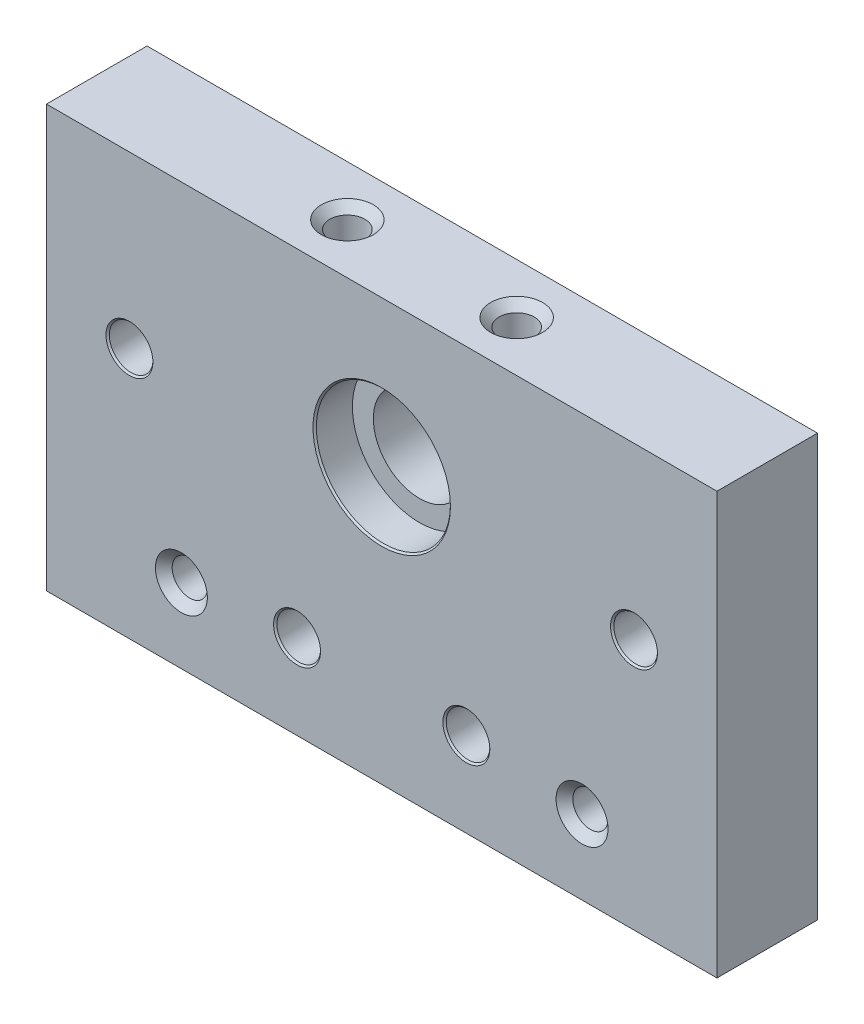
ISO-10303-21;
HEADER;
FILE_DESCRIPTION(('STEP AP214'),'2;1');
FILE_NAME('part.step','',(''),(''),'','','');
FILE_SCHEMA(('AUTOMOTIVE_DESIGN { 1 0 10303 214 1 1 1 1 }'));
ENDSEC;
DATA;
#1=APPLICATION_CONTEXT('core data for automotive mechanical design processes');
#2=APPLICATION_PROTOCOL_DEFINITION('international standard','automotive_design',2000,#1);
#3=PRODUCT_CONTEXT('',#1,'mechanical');
#4=PRODUCT('Part','Part','',(#3));
#5=PRODUCT_RELATED_PRODUCT_CATEGORY('part','',(#4));
#6=PRODUCT_DEFINITION_FORMATION('','',#4);
#7=PRODUCT_DEFINITION_CONTEXT('part definition',#1,'design');
#8=PRODUCT_DEFINITION('design','',#6,#7);
#9=PRODUCT_DEFINITION_SHAPE('','',#8);
#10=(LENGTH_UNIT() NAMED_UNIT(*) SI_UNIT(.MILLI.,.METRE.));
#11=(NAMED_UNIT(*) PLANE_ANGLE_UNIT() SI_UNIT($,.RADIAN.));
#12=(NAMED_UNIT(*) SI_UNIT($,.STERADIAN.) SOLID_ANGLE_UNIT());
#13=UNCERTAINTY_MEASURE_WITH_UNIT(LENGTH_MEASURE(1.E-05),#10,'distance_accuracy_value','');
#14=(GEOMETRIC_REPRESENTATION_CONTEXT(3) GLOBAL_UNCERTAINTY_ASSIGNED_CONTEXT((#13)) GLOBAL_UNIT_ASSIGNED_CONTEXT((#10,
#11,#12)) REPRESENTATION_CONTEXT('',''));
#15=CARTESIAN_POINT('',(0.,0.,0.));
#16=DIRECTION('',(0.,0.,1.));
#17=DIRECTION('',(1.,0.,0.));
#18=AXIS2_PLACEMENT_3D('',#15,#16,#17);
#19=CARTESIAN_POINT('',(28.7831305387227,6.79975085139503,5.36743547306151));
#20=DIRECTION('',(0.,0.,-1.));
#21=DIRECTION('',(-1.,0.,0.));
#22=AXIS2_PLACEMENT_3D('',#19,#20,#21);
#23=CYLINDRICAL_SURFACE('',#22,2.6);
#24=CARTESIAN_POINT('',(28.7831305387227,6.79975085139503,5.1674354730615));
#25=DIRECTION('',(0.,0.,1.));
#26=DIRECTION('',(1.,0.,0.));
#27=AXIS2_PLACEMENT_3D('',#24,#25,#26);
#28=CIRCLE('',#27,2.6);
#29=CARTESIAN_POINT('',(31.3831305387227,6.79975085139503,5.1674354730615));
#30=VERTEX_POINT('',#29);
#31=EDGE_CURVE('E141',#30,#30,#28,.T.);
#32=ORIENTED_EDGE('',*,*,#31,.T.);
#33=EDGE_LOOP('',(#32));
#34=FACE_BOUND('',#33,.T.);
#35=CARTESIAN_POINT('',(28.7831305387227,6.79975085139503,-4.63256452693849));
#36=DIRECTION('',(0.,0.,-1.));
#37=DIRECTION('',(-1.,0.,0.));
#38=AXIS2_PLACEMENT_3D('',#35,#36,#37);
#39=CIRCLE('',#38,2.6);
#40=CARTESIAN_POINT('',(26.1831305387227,6.79975085139503,-4.63256452693849));
#41=VERTEX_POINT('',#40);
#42=EDGE_CURVE('E108',#41,#41,#39,.T.);
#43=ORIENTED_EDGE('',*,*,#42,.T.);
#44=EDGE_LOOP('',(#43));
#45=FACE_BOUND('',#44,.T.);
#46=ADVANCED_FACE('F16',(#34,#45),#23,.F.);
#47=CARTESIAN_POINT('',(8.78313053872271,-13.100249148605,5.36743547306151));
#48=DIRECTION('',(0.,0.,-1.));
#49=DIRECTION('',(-1.,0.,0.));
#50=AXIS2_PLACEMENT_3D('',#47,#48,#49);
#51=CYLINDRICAL_SURFACE('',#50,2.6);
#52=CARTESIAN_POINT('',(8.78313053872271,-13.100249148605,5.1674354730615));
#53=DIRECTION('',(0.,0.,1.));
#54=DIRECTION('',(1.,0.,0.));
#55=AXIS2_PLACEMENT_3D('',#52,#53,#54);
#56=CIRCLE('',#55,2.6);
#57=CARTESIAN_POINT('',(11.3831305387227,-13.100249148605,5.1674354730615));
#58=VERTEX_POINT('',#57);
#59=EDGE_CURVE('E159',#58,#58,#56,.T.);
#60=ORIENTED_EDGE('',*,*,#59,.T.);
#61=EDGE_LOOP('',(#60));
#62=FACE_BOUND('',#61,.T.);
#63=CARTESIAN_POINT('',(8.78313053872271,-13.100249148605,-4.63256452693849));
#64=DIRECTION('',(0.,0.,-1.));
#65=DIRECTION('',(-1.,0.,0.));
#66=AXIS2_PLACEMENT_3D('',#63,#64,#65);
#67=CIRCLE('',#66,2.6);
#68=CARTESIAN_POINT('',(6.18313053872271,-13.100249148605,-4.63256452693849));
#69=VERTEX_POINT('',#68);
#70=EDGE_CURVE('E105',#69,#69,#67,.T.);
#71=ORIENTED_EDGE('',*,*,#70,.T.);
#72=EDGE_LOOP('',(#71));
#73=FACE_BOUND('',#72,.T.);
#74=ADVANCED_FACE('F216',(#62,#73),#51,.F.);
#75=CARTESIAN_POINT('',(-31.4168694612773,6.79975085139502,5.36743547306151));
#76=DIRECTION('',(0.,0.,-1.));
#77=DIRECTION('',(-1.,0.,0.));
#78=AXIS2_PLACEMENT_3D('',#75,#76,#77);
#79=CYLINDRICAL_SURFACE('',#78,2.6);
#80=CARTESIAN_POINT('',(-31.4168694612773,6.79975085139502,5.1674354730615));
#81=DIRECTION('',(0.,0.,1.));
#82=DIRECTION('',(1.,0.,0.));
#83=AXIS2_PLACEMENT_3D('',#80,#81,#82);
#84=CIRCLE('',#83,2.6);
#85=CARTESIAN_POINT('',(-28.8168694612773,6.79975085139502,5.1674354730615));
#86=VERTEX_POINT('',#85);
#87=EDGE_CURVE('E168',#86,#86,#84,.T.);
#88=ORIENTED_EDGE('',*,*,#87,.T.);
#89=EDGE_LOOP('',(#88));
#90=FACE_BOUND('',#89,.T.);
#91=CARTESIAN_POINT('',(-31.4168694612773,6.79975085139502,-4.63256452693849));
#92=DIRECTION('',(0.,0.,-1.));
#93=DIRECTION('',(-1.,0.,0.));
#94=AXIS2_PLACEMENT_3D('',#91,#92,#93);
#95=CIRCLE('',#94,2.6);
#96=CARTESIAN_POINT('',(-34.0168694612773,6.79975085139502,-4.63256452693849));
#97=VERTEX_POINT('',#96);
#98=EDGE_CURVE('E101',#97,#97,#95,.T.);
#99=ORIENTED_EDGE('',*,*,#98,.T.);
#100=EDGE_LOOP('',(#99));
#101=FACE_BOUND('',#100,.T.);
#102=ADVANCED_FACE('F222',(#90,#101),#79,.F.);
#103=CARTESIAN_POINT('',(-11.4168694612773,-13.100249148605,5.36743547306151));
#104=DIRECTION('',(0.,0.,-1.));
#105=DIRECTION('',(-1.,0.,0.));
#106=AXIS2_PLACEMENT_3D('',#103,#104,#105);
#107=CYLINDRICAL_SURFACE('',#106,2.6);
#108=CARTESIAN_POINT('',(-11.4168694612773,-13.100249148605,5.1674354730615));
#109=DIRECTION('',(0.,0.,1.));
#110=DIRECTION('',(1.,0.,0.));
#111=AXIS2_PLACEMENT_3D('',#108,#109,#110);
#112=CIRCLE('',#111,2.6);
#113=CARTESIAN_POINT('',(-8.81686946127732,-13.100249148605,5.1674354730615));
#114=VERTEX_POINT('',#113);
#115=EDGE_CURVE('E162',#114,#114,#112,.T.);
#116=ORIENTED_EDGE('',*,*,#115,.T.);
#117=EDGE_LOOP('',(#116));
#118=FACE_BOUND('',#117,.T.);
#119=CARTESIAN_POINT('',(-11.4168694612773,-13.100249148605,-4.63256452693849));
#120=DIRECTION('',(0.,0.,-1.));
#121=DIRECTION('',(-1.,0.,0.));
#122=AXIS2_PLACEMENT_3D('',#119,#120,#121);
#123=CIRCLE('',#122,2.6);
#124=CARTESIAN_POINT('',(-14.0168694612773,-13.100249148605,-4.63256452693849));
#125=VERTEX_POINT('',#124);
#126=EDGE_CURVE('E98',#125,#125,#123,.T.);
#127=ORIENTED_EDGE('',*,*,#126,.T.);
#128=EDGE_LOOP('',(#127));
#129=FACE_BOUND('',#128,.T.);
#130=ADVANCED_FACE('F231',(#118,#129),#107,.F.);
#131=CARTESIAN_POINT('',(-1.31686946127731,9.59975085139505,5.36743547306151));
#132=DIRECTION('',(0.,0.,-1.));
#133=DIRECTION('',(-1.,0.,0.));
#134=AXIS2_PLACEMENT_3D('',#131,#132,#133);
#135=CYLINDRICAL_SURFACE('',#134,5.5);
#136=CARTESIAN_POINT('',(-1.31686946127731,9.59975085139505,-6.43256452693849));
#137=DIRECTION('',(0.,0.,1.));
#138=DIRECTION('',(1.,0.,0.));
#139=AXIS2_PLACEMENT_3D('',#136,#137,#138);
#140=CIRCLE('',#139,5.5);
#141=CARTESIAN_POINT('',(4.18313053872269,9.59975085139505,-6.43256452693849));
#142=VERTEX_POINT('',#141);
#143=EDGE_CURVE('E135',#142,#142,#140,.F.);
#144=ORIENTED_EDGE('',*,*,#143,.T.);
#145=EDGE_LOOP('',(#144));
#146=FACE_BOUND('',#145,.T.);
#147=CARTESIAN_POINT('',(-1.31686946127731,9.59975085139505,0.867435473061505));
#148=DIRECTION('',(0.,0.,1.));
#149=DIRECTION('',(1.,0.,0.));
#150=AXIS2_PLACEMENT_3D('',#147,#148,#149);
#151=CIRCLE('',#150,5.5);
#152=CARTESIAN_POINT('',(4.18313053872269,9.59975085139505,0.867435473061505));
#153=VERTEX_POINT('',#152);
#154=EDGE_CURVE('E87',#153,#153,#151,.T.);
#155=ORIENTED_EDGE('',*,*,#154,.T.);
#156=EDGE_LOOP('',(#155));
#157=FACE_BOUND('',#156,.T.);
#158=ADVANCED_FACE('F228',(#146,#157),#135,.F.);
#159=CARTESIAN_POINT('',(-1.31686946127731,1.94975085139505,5.36743547306151));
#160=DIRECTION('',(0.,0.,1.));
#161=DIRECTION('',(1.,0.,0.));
#162=AXIS2_PLACEMENT_3D('',#159,#160,#161);
#163=PLANE('',#162);
#164=CARTESIAN_POINT('',(22.5831305387227,-14.300249148605,5.36743547306151));
#165=DIRECTION('',(0.,0.,1.));
#166=DIRECTION('',(1.,0.,0.));
#167=AXIS2_PLACEMENT_3D('',#164,#165,#166);
#168=CIRCLE('',#167,3.10000000000001);
#169=CARTESIAN_POINT('',(25.6831305387227,-14.300249148605,5.36743547306151));
#170=VERTEX_POINT('',#169);
#171=EDGE_CURVE('E198',#170,#170,#168,.F.);
#172=ORIENTED_EDGE('',*,*,#171,.T.);
#173=EDGE_LOOP('',(#172));
#174=FACE_BOUND('',#173,.T.);
#175=CARTESIAN_POINT('',(-25.2168694612773,-14.300249148605,5.36743547306151));
#176=DIRECTION('',(0.,0.,1.));
#177=DIRECTION('',(1.,0.,0.));
#178=AXIS2_PLACEMENT_3D('',#175,#176,#177);
#179=CIRCLE('',#178,3.09999999999999);
#180=CARTESIAN_POINT('',(-22.1168694612773,-14.300249148605,5.36743547306151));
#181=VERTEX_POINT('',#180);
#182=EDGE_CURVE('E195',#181,#181,#179,.F.);
#183=ORIENTED_EDGE('',*,*,#182,.T.);
#184=EDGE_LOOP('',(#183));
#185=FACE_BOUND('',#184,.T.);
#186=CARTESIAN_POINT('',(28.7831305387227,6.79975085139503,5.36743547306151));
#187=DIRECTION('',(0.,0.,1.));
#188=DIRECTION('',(1.,0.,0.));
#189=AXIS2_PLACEMENT_3D('',#186,#187,#188);
#190=CIRCLE('',#189,2.8);
#191=CARTESIAN_POINT('',(31.5831305387227,6.79975085139503,5.36743547306151));
#192=VERTEX_POINT('',#191);
#193=EDGE_CURVE('E156',#192,#192,#190,.F.);
#194=ORIENTED_EDGE('',*,*,#193,.T.);
#195=EDGE_LOOP('',(#194));
#196=FACE_BOUND('',#195,.T.);
#197=CARTESIAN_POINT('',(8.78313053872271,-13.100249148605,5.36743547306151));
#198=DIRECTION('',(0.,0.,1.));
#199=DIRECTION('',(1.,0.,0.));
#200=AXIS2_PLACEMENT_3D('',#197,#198,#199);
#201=CIRCLE('',#200,2.8);
#202=CARTESIAN_POINT('',(11.5831305387227,-13.100249148605,5.36743547306151));
#203=VERTEX_POINT('',#202);
#204=EDGE_CURVE('E153',#203,#203,#201,.F.);
#205=ORIENTED_EDGE('',*,*,#204,.T.);
#206=EDGE_LOOP('',(#205));
#207=FACE_BOUND('',#206,.T.);
#208=CARTESIAN_POINT('',(-11.4168694612773,-13.100249148605,5.36743547306151));
#209=DIRECTION('',(0.,0.,1.));
#210=DIRECTION('',(1.,0.,0.));
#211=AXIS2_PLACEMENT_3D('',#208,#209,#210);
#212=CIRCLE('',#211,2.8);
#213=CARTESIAN_POINT('',(-8.61686946127733,-13.100249148605,5.36743547306151));
#214=VERTEX_POINT('',#213);
#215=EDGE_CURVE('E150',#214,#214,#212,.F.);
#216=ORIENTED_EDGE('',*,*,#215,.T.);
#217=EDGE_LOOP('',(#216));
#218=FACE_BOUND('',#217,.T.);
#219=CARTESIAN_POINT('',(-1.31686946127731,9.59975085139505,5.36743547306151));
#220=DIRECTION('',(0.,0.,1.));
#221=DIRECTION('',(1.,0.,0.));
#222=AXIS2_PLACEMENT_3D('',#219,#220,#221);
#223=CIRCLE('',#222,8.2);
#224=CARTESIAN_POINT('',(6.88313053872269,9.59975085139505,5.36743547306151));
#225=VERTEX_POINT('',#224);
#226=EDGE_CURVE('E147',#225,#225,#223,.F.);
#227=ORIENTED_EDGE('',*,*,#226,.T.);
#228=EDGE_LOOP('',(#227));
#229=FACE_BOUND('',#228,.T.);
#230=CARTESIAN_POINT('',(-31.4168694612773,6.79975085139502,5.36743547306151));
#231=DIRECTION('',(0.,0.,1.));
#232=DIRECTION('',(1.,0.,0.));
#233=AXIS2_PLACEMENT_3D('',#230,#231,#232);
#234=CIRCLE('',#233,2.8);
#235=CARTESIAN_POINT('',(-28.6168694612773,6.79975085139502,5.36743547306151));
#236=VERTEX_POINT('',#235);
#237=EDGE_CURVE('E144',#236,#236,#234,.F.);
#238=ORIENTED_EDGE('',*,*,#237,.T.);
#239=EDGE_LOOP('',(#238));
#240=FACE_BOUND('',#239,.T.);
#241=DIRECTION('',(0.,-1.,0.));
#242=VECTOR('',#241,1.);
#243=CARTESIAN_POINT('',(-41.3168694612773,-23.200249148605,5.36743547306151));
#244=LINE('',#243,#242);
#245=CARTESIAN_POINT('',(-41.3168694612773,27.099750851395,5.36743547306151));
#246=VERTEX_POINT('',#245);
#247=CARTESIAN_POINT('',(-41.3168694612773,-23.200249148605,5.36743547306151));
#248=VERTEX_POINT('',#247);
#249=EDGE_CURVE('E69',#246,#248,#244,.T.);
#250=ORIENTED_EDGE('',*,*,#249,.T.);
#251=DIRECTION('',(1.,0.,0.));
#252=VECTOR('',#251,1.);
#253=CARTESIAN_POINT('',(38.6831305387227,-23.200249148605,5.36743547306151));
#254=LINE('',#253,#252);
#255=CARTESIAN_POINT('',(38.6831305387227,-23.200249148605,5.36743547306151));
#256=VERTEX_POINT('',#255);
#257=EDGE_CURVE('E64',#248,#256,#254,.T.);
#258=ORIENTED_EDGE('',*,*,#257,.T.);
#259=DIRECTION('',(0.,1.,0.));
#260=VECTOR('',#259,1.);
#261=CARTESIAN_POINT('',(38.6831305387227,-23.200249148605,5.36743547306151));
#262=LINE('',#261,#260);
#263=CARTESIAN_POINT('',(38.6831305387227,27.099750851395,5.36743547306151));
#264=VERTEX_POINT('',#263);
#265=EDGE_CURVE('E67',#256,#264,#262,.T.);
#266=ORIENTED_EDGE('',*,*,#265,.T.);
#267=DIRECTION('',(-1.,0.,0.));
#268=VECTOR('',#267,1.);
#269=CARTESIAN_POINT('',(38.6831305387227,27.099750851395,5.36743547306151));
#270=LINE('',#269,#268);
#271=EDGE_CURVE('E33',#264,#246,#270,.T.);
#272=ORIENTED_EDGE('',*,*,#271,.T.);
#273=EDGE_LOOP('',(#250,#258,#266,#272));
#274=FACE_BOUND('',#273,.T.);
#275=ADVANCED_FACE('F65',(#174,#185,#196,#207,#218,#229,#240,#274),#163,.T.);
#276=CARTESIAN_POINT('',(-1.31686946127731,1.94975085139505,-6.63256452693849));
#277=DIRECTION('',(0.,0.,1.));
#278=DIRECTION('',(1.,0.,0.));
#279=AXIS2_PLACEMENT_3D('',#276,#277,#278);
#280=PLANE('',#279);
#281=CARTESIAN_POINT('',(22.5831305387227,-14.300249148605,-6.63256452693849));
#282=DIRECTION('',(0.,0.,1.));
#283=DIRECTION('',(1.,0.,0.));
#284=AXIS2_PLACEMENT_3D('',#281,#282,#283);
#285=CIRCLE('',#284,3.10000000000002);
#286=CARTESIAN_POINT('',(25.6831305387227,-14.300249148605,-6.63256452693849));
#287=VERTEX_POINT('',#286);
#288=EDGE_CURVE('E186',#287,#287,#285,.T.);
#289=ORIENTED_EDGE('',*,*,#288,.T.);
#290=EDGE_LOOP('',(#289));
#291=FACE_BOUND('',#290,.T.);
#292=CARTESIAN_POINT('',(-25.2168694612773,-14.300249148605,-6.63256452693849));
#293=DIRECTION('',(0.,0.,1.));
#294=DIRECTION('',(1.,0.,0.));
#295=AXIS2_PLACEMENT_3D('',#292,#293,#294);
#296=CIRCLE('',#295,3.10000000000002);
#297=CARTESIAN_POINT('',(-22.1168694612773,-14.300249148605,-6.63256452693849));
#298=VERTEX_POINT('',#297);
#299=EDGE_CURVE('E183',#298,#298,#296,.T.);
#300=ORIENTED_EDGE('',*,*,#299,.T.);
#301=EDGE_LOOP('',(#300));
#302=FACE_BOUND('',#301,.T.);
#303=CARTESIAN_POINT('',(-31.4168694612773,6.79975085139502,-6.63256452693849));
#304=DIRECTION('',(0.,0.,1.));
#305=DIRECTION('',(1.,0.,0.));
#306=AXIS2_PLACEMENT_3D('',#303,#304,#305);
#307=CIRCLE('',#306,4.7);
#308=CARTESIAN_POINT('',(-26.7168694612773,6.79975085139502,-6.63256452693849));
#309=VERTEX_POINT('',#308);
#310=EDGE_CURVE('E126',#309,#309,#307,.T.);
#311=ORIENTED_EDGE('',*,*,#310,.T.);
#312=EDGE_LOOP('',(#311));
#313=FACE_BOUND('',#312,.T.);
#314=CARTESIAN_POINT('',(-11.4168694612773,-13.100249148605,-6.63256452693849));
#315=DIRECTION('',(0.,0.,1.));
#316=DIRECTION('',(1.,0.,0.));
#317=AXIS2_PLACEMENT_3D('',#314,#315,#316);
#318=CIRCLE('',#317,4.7);
#319=CARTESIAN_POINT('',(-6.71686946127733,-13.100249148605,-6.63256452693849));
#320=VERTEX_POINT('',#319);
#321=EDGE_CURVE('E123',#320,#320,#318,.T.);
#322=ORIENTED_EDGE('',*,*,#321,.T.);
#323=EDGE_LOOP('',(#322));
#324=FACE_BOUND('',#323,.T.);
#325=CARTESIAN_POINT('',(8.78313053872271,-13.100249148605,-6.63256452693849));
#326=DIRECTION('',(0.,0.,1.));
#327=DIRECTION('',(1.,0.,0.));
#328=AXIS2_PLACEMENT_3D('',#325,#326,#327);
#329=CIRCLE('',#328,4.7);
#330=CARTESIAN_POINT('',(13.4831305387227,-13.100249148605,-6.63256452693849));
#331=VERTEX_POINT('',#330);
#332=EDGE_CURVE('E120',#331,#331,#329,.T.);
#333=ORIENTED_EDGE('',*,*,#332,.T.);
#334=EDGE_LOOP('',(#333));
#335=FACE_BOUND('',#334,.T.);
#336=CARTESIAN_POINT('',(-1.31686946127731,9.59975085139505,-6.63256452693849));
#337=DIRECTION('',(0.,0.,1.));
#338=DIRECTION('',(1.,0.,0.));
#339=AXIS2_PLACEMENT_3D('',#336,#337,#338);
#340=CIRCLE('',#339,5.7);
#341=CARTESIAN_POINT('',(4.38313053872269,9.59975085139505,-6.63256452693849));
#342=VERTEX_POINT('',#341);
#343=EDGE_CURVE('E117',#342,#342,#340,.T.);
#344=ORIENTED_EDGE('',*,*,#343,.T.);
#345=EDGE_LOOP('',(#344));
#346=FACE_BOUND('',#345,.T.);
#347=CARTESIAN_POINT('',(28.7831305387227,6.79975085139503,-6.63256452693849));
#348=DIRECTION('',(0.,0.,1.));
#349=DIRECTION('',(1.,0.,0.));
#350=AXIS2_PLACEMENT_3D('',#347,#348,#349);
#351=CIRCLE('',#350,4.7);
#352=CARTESIAN_POINT('',(33.4831305387227,6.79975085139503,-6.63256452693849));
#353=VERTEX_POINT('',#352);
#354=EDGE_CURVE('E114',#353,#353,#351,.T.);
#355=ORIENTED_EDGE('',*,*,#354,.T.);
#356=EDGE_LOOP('',(#355));
#357=FACE_BOUND('',#356,.T.);
#358=DIRECTION('',(0.,-1.,0.));
#359=VECTOR('',#358,1.);
#360=CARTESIAN_POINT('',(-41.3168694612773,-23.200249148605,-6.63256452693849));
#361=LINE('',#360,#359);
#362=CARTESIAN_POINT('',(-41.3168694612773,27.099750851395,-6.63256452693849));
#363=VERTEX_POINT('',#362);
#364=CARTESIAN_POINT('',(-41.3168694612773,-23.200249148605,-6.63256452693849));
#365=VERTEX_POINT('',#364);
#366=EDGE_CURVE('E84',#363,#365,#361,.T.);
#367=ORIENTED_EDGE('',*,*,#366,.F.);
#368=DIRECTION('',(-1.,0.,0.));
#369=VECTOR('',#368,1.);
#370=CARTESIAN_POINT('',(38.6831305387227,27.099750851395,-6.63256452693849));
#371=LINE('',#370,#369);
#372=CARTESIAN_POINT('',(38.6831305387227,27.099750851395,-6.63256452693849));
#373=VERTEX_POINT('',#372);
#374=EDGE_CURVE('E56',#373,#363,#371,.T.);
#375=ORIENTED_EDGE('',*,*,#374,.F.);
#376=DIRECTION('',(0.,1.,0.));
#377=VECTOR('',#376,1.);
#378=CARTESIAN_POINT('',(38.6831305387227,-23.200249148605,-6.63256452693849));
#379=LINE('',#378,#377);
#380=CARTESIAN_POINT('',(38.6831305387227,-23.200249148605,-6.63256452693849));
#381=VERTEX_POINT('',#380);
#382=EDGE_CURVE('E50',#381,#373,#379,.T.);
#383=ORIENTED_EDGE('',*,*,#382,.F.);
#384=DIRECTION('',(1.,0.,0.));
#385=VECTOR('',#384,1.);
#386=CARTESIAN_POINT('',(38.6831305387227,-23.200249148605,-6.63256452693849));
#387=LINE('',#386,#385);
#388=EDGE_CURVE('E74',#365,#381,#387,.T.);
#389=ORIENTED_EDGE('',*,*,#388,.F.);
#390=EDGE_LOOP('',(#367,#375,#383,#389));
#391=FACE_BOUND('',#390,.T.);
#392=ADVANCED_FACE('F235',(#291,#302,#313,#324,#335,#346,#357,#391),#280,.F.);
#393=CARTESIAN_POINT('',(-41.3168694612773,-23.200249148605,5.36743547306151));
#394=DIRECTION('',(1.,0.,0.));
#395=DIRECTION('',(0.,0.,-1.));
#396=AXIS2_PLACEMENT_3D('',#393,#394,#395);
#397=PLANE('',#396);
#398=ORIENTED_EDGE('',*,*,#366,.T.);
#399=DIRECTION('',(0.,0.,-1.));
#400=VECTOR('',#399,1.);
#401=CARTESIAN_POINT('',(-41.3168694612773,-23.200249148605,5.36743547306151));
#402=LINE('',#401,#400);
#403=EDGE_CURVE('E75',#248,#365,#402,.T.);
#404=ORIENTED_EDGE('',*,*,#403,.F.);
#405=ORIENTED_EDGE('',*,*,#249,.F.);
#406=DIRECTION('',(0.,0.,-1.));
#407=VECTOR('',#406,1.);
#408=CARTESIAN_POINT('',(-41.3168694612773,27.099750851395,5.36743547306151));
#409=LINE('',#408,#407);
#410=EDGE_CURVE('E80',#246,#363,#409,.T.);
#411=ORIENTED_EDGE('',*,*,#410,.T.);
#412=EDGE_LOOP('',(#398,#404,#405,#411));
#413=FACE_BOUND('',#412,.T.);
#414=ADVANCED_FACE('F239',(#413),#397,.F.);
#415=CARTESIAN_POINT('',(38.6831305387227,-23.200249148605,5.36743547306151));
#416=DIRECTION('',(0.,1.,0.));
#417=DIRECTION('',(-1.,0.,0.));
#418=AXIS2_PLACEMENT_3D('',#415,#416,#417);
#419=PLANE('',#418);
#420=ORIENTED_EDGE('',*,*,#388,.T.);
#421=DIRECTION('',(0.,0.,-1.));
#422=VECTOR('',#421,1.);
#423=CARTESIAN_POINT('',(38.6831305387227,-23.200249148605,5.36743547306151));
#424=LINE('',#423,#422);
#425=EDGE_CURVE('E72',#256,#381,#424,.T.);
#426=ORIENTED_EDGE('',*,*,#425,.F.);
#427=ORIENTED_EDGE('',*,*,#257,.F.);
#428=ORIENTED_EDGE('',*,*,#403,.T.);
#429=EDGE_LOOP('',(#420,#426,#427,#428));
#430=FACE_BOUND('',#429,.T.);
#431=ADVANCED_FACE('F73',(#430),#419,.F.);
#432=CARTESIAN_POINT('',(38.6831305387227,-23.200249148605,5.36743547306151));
#433=DIRECTION('',(-1.,0.,0.));
#434=DIRECTION('',(0.,0.,1.));
#435=AXIS2_PLACEMENT_3D('',#432,#433,#434);
#436=PLANE('',#435);
#437=ORIENTED_EDGE('',*,*,#382,.T.);
#438=DIRECTION('',(0.,0.,-1.));
#439=VECTOR('',#438,1.);
#440=CARTESIAN_POINT('',(38.6831305387227,27.099750851395,5.36743547306151));
#441=LINE('',#440,#439);
#442=EDGE_CURVE('E76',#264,#373,#441,.T.);
#443=ORIENTED_EDGE('',*,*,#442,.F.);
#444=ORIENTED_EDGE('',*,*,#265,.F.);
#445=ORIENTED_EDGE('',*,*,#425,.T.);
#446=EDGE_LOOP('',(#437,#443,#444,#445));
#447=FACE_BOUND('',#446,.T.);
#448=ADVANCED_FACE('F78',(#447),#436,.F.);
#449=CARTESIAN_POINT('',(38.6831305387227,27.099750851395,5.36743547306151));
#450=DIRECTION('',(0.,-1.,0.));
#451=DIRECTION('',(1.,0.,0.));
#452=AXIS2_PLACEMENT_3D('',#449,#450,#451);
#453=PLANE('',#452);
#454=CARTESIAN_POINT('',(8.78313053872266,27.099750851395,-0.632564526938498));
#455=DIRECTION('',(0.,-1.,0.));
#456=DIRECTION('',(1.,0.,0.));
#457=AXIS2_PLACEMENT_3D('',#454,#455,#456);
#458=CIRCLE('',#457,3.10000000000001);
#459=CARTESIAN_POINT('',(11.8831305387227,27.099750851395,-0.632564526938498));
#460=VERTEX_POINT('',#459);
#461=EDGE_CURVE('E177',#460,#460,#458,.T.);
#462=ORIENTED_EDGE('',*,*,#461,.T.);
#463=EDGE_LOOP('',(#462));
#464=FACE_BOUND('',#463,.T.);
#465=CARTESIAN_POINT('',(-11.4168694612773,27.099750851395,-0.632564526938495));
#466=DIRECTION('',(0.,-1.,0.));
#467=DIRECTION('',(1.,0.,0.));
#468=AXIS2_PLACEMENT_3D('',#465,#466,#467);
#469=CIRCLE('',#468,3.1);
#470=CARTESIAN_POINT('',(-8.3168694612773,27.099750851395,-0.632564526938495));
#471=VERTEX_POINT('',#470);
#472=EDGE_CURVE('E174',#471,#471,#469,.T.);
#473=ORIENTED_EDGE('',*,*,#472,.T.);
#474=EDGE_LOOP('',(#473));
#475=FACE_BOUND('',#474,.T.);
#476=ORIENTED_EDGE('',*,*,#374,.T.);
#477=ORIENTED_EDGE('',*,*,#410,.F.);
#478=ORIENTED_EDGE('',*,*,#271,.F.);
#479=ORIENTED_EDGE('',*,*,#442,.T.);
#480=EDGE_LOOP('',(#476,#477,#478,#479));
#481=FACE_BOUND('',#480,.T.);
#482=ADVANCED_FACE('F241',(#464,#475,#481),#453,.F.);
#483=CARTESIAN_POINT('',(22.5831305387227,-14.300249148605,5.36743547306151));
#484=DIRECTION('',(0.,0.,-1.));
#485=DIRECTION('',(-1.,0.,0.));
#486=AXIS2_PLACEMENT_3D('',#483,#484,#485);
#487=CYLINDRICAL_SURFACE('',#486,2.1);
#488=CARTESIAN_POINT('',(22.5831305387227,-14.300249148605,-5.63256452693847));
#489=DIRECTION('',(0.,0.,1.));
#490=DIRECTION('',(1.,0.,0.));
#491=AXIS2_PLACEMENT_3D('',#488,#489,#490);
#492=CIRCLE('',#491,2.1);
#493=CARTESIAN_POINT('',(24.6831305387227,-14.300249148605,-5.63256452693847));
#494=VERTEX_POINT('',#493);
#495=EDGE_CURVE('E192',#494,#494,#492,.F.);
#496=ORIENTED_EDGE('',*,*,#495,.T.);
#497=EDGE_LOOP('',(#496));
#498=FACE_BOUND('',#497,.T.);
#499=CARTESIAN_POINT('',(22.5831305387227,-14.300249148605,4.36743547306149));
#500=DIRECTION('',(0.,0.,1.));
#501=DIRECTION('',(1.,0.,0.));
#502=AXIS2_PLACEMENT_3D('',#499,#500,#501);
#503=CIRCLE('',#502,2.1);
#504=CARTESIAN_POINT('',(24.6831305387227,-14.300249148605,4.36743547306149));
#505=VERTEX_POINT('',#504);
#506=EDGE_CURVE('E189',#505,#505,#503,.T.);
#507=ORIENTED_EDGE('',*,*,#506,.T.);
#508=EDGE_LOOP('',(#507));
#509=FACE_BOUND('',#508,.T.);
#510=ADVANCED_FACE('F244',(#498,#509),#487,.F.);
#511=CARTESIAN_POINT('',(-25.2168694612773,-14.300249148605,5.36743547306151));
#512=DIRECTION('',(0.,0.,-1.));
#513=DIRECTION('',(-1.,0.,0.));
#514=AXIS2_PLACEMENT_3D('',#511,#512,#513);
#515=CYLINDRICAL_SURFACE('',#514,2.1);
#516=CARTESIAN_POINT('',(-25.2168694612773,-14.300249148605,-5.63256452693847));
#517=DIRECTION('',(0.,0.,1.));
#518=DIRECTION('',(1.,0.,0.));
#519=AXIS2_PLACEMENT_3D('',#516,#517,#518);
#520=CIRCLE('',#519,2.1);
#521=CARTESIAN_POINT('',(-23.1168694612773,-14.300249148605,-5.63256452693847));
#522=VERTEX_POINT('',#521);
#523=EDGE_CURVE('E10',#522,#522,#520,.F.);
#524=ORIENTED_EDGE('',*,*,#523,.T.);
#525=EDGE_LOOP('',(#524));
#526=FACE_BOUND('',#525,.T.);
#527=CARTESIAN_POINT('',(-25.2168694612773,-14.300249148605,4.36743547306152));
#528=DIRECTION('',(0.,0.,1.));
#529=DIRECTION('',(1.,0.,0.));
#530=AXIS2_PLACEMENT_3D('',#527,#528,#529);
#531=CIRCLE('',#530,2.1);
#532=CARTESIAN_POINT('',(-23.1168694612773,-14.300249148605,4.36743547306152));
#533=VERTEX_POINT('',#532);
#534=EDGE_CURVE('E25',#533,#533,#531,.T.);
#535=ORIENTED_EDGE('',*,*,#534,.T.);
#536=EDGE_LOOP('',(#535));
#537=FACE_BOUND('',#536,.T.);
#538=ADVANCED_FACE('F203',(#526,#537),#515,.F.);
#539=CARTESIAN_POINT('',(-1.31686946127731,9.59975085139505,0.867435473061505));
#540=DIRECTION('',(0.,0.,1.));
#541=DIRECTION('',(1.,0.,0.));
#542=AXIS2_PLACEMENT_3D('',#539,#540,#541);
#543=CYLINDRICAL_SURFACE('',#542,8.);
#544=CARTESIAN_POINT('',(-1.31686946127731,9.59975085139505,5.16743547306151));
#545=DIRECTION('',(0.,0.,1.));
#546=DIRECTION('',(1.,0.,0.));
#547=AXIS2_PLACEMENT_3D('',#544,#545,#546);
#548=CIRCLE('',#547,8.);
#549=CARTESIAN_POINT('',(6.68313053872269,9.59975085139505,5.16743547306151));
#550=VERTEX_POINT('',#549);
#551=EDGE_CURVE('E165',#550,#550,#548,.T.);
#552=ORIENTED_EDGE('',*,*,#551,.T.);
#553=EDGE_LOOP('',(#552));
#554=FACE_BOUND('',#553,.T.);
#555=CARTESIAN_POINT('',(-1.31686946127731,9.59975085139505,0.867435473061505));
#556=DIRECTION('',(0.,0.,1.));
#557=DIRECTION('',(1.,0.,0.));
#558=AXIS2_PLACEMENT_3D('',#555,#556,#557);
#559=CIRCLE('',#558,8.);
#560=CARTESIAN_POINT('',(6.68313053872269,9.59975085139505,0.867435473061505));
#561=VERTEX_POINT('',#560);
#562=EDGE_CURVE('E97',#561,#561,#559,.T.);
#563=ORIENTED_EDGE('',*,*,#562,.F.);
#564=EDGE_LOOP('',(#563));
#565=FACE_BOUND('',#564,.T.);
#566=ADVANCED_FACE('F319',(#554,#565),#543,.F.);
#567=CARTESIAN_POINT('',(-1.31686946127731,9.59975085139505,0.867435473061505));
#568=DIRECTION('',(0.,0.,1.));
#569=DIRECTION('',(1.,0.,0.));
#570=AXIS2_PLACEMENT_3D('',#567,#568,#569);
#571=PLANE('',#570);
#572=ORIENTED_EDGE('',*,*,#154,.F.);
#573=EDGE_LOOP('',(#572));
#574=FACE_BOUND('',#573,.T.);
#575=ORIENTED_EDGE('',*,*,#562,.T.);
#576=EDGE_LOOP('',(#575));
#577=FACE_BOUND('',#576,.T.);
#578=ADVANCED_FACE('F331',(#574,#577),#571,.T.);
#579=CARTESIAN_POINT('',(8.78313053872266,16.099750851395,-0.632564526938498));
#580=DIRECTION('',(0.,1.,0.));
#581=DIRECTION('',(-1.,0.,0.));
#582=AXIS2_PLACEMENT_3D('',#579,#580,#581);
#583=CYLINDRICAL_SURFACE('',#582,2.1);
#584=CARTESIAN_POINT('',(8.78313053872266,26.099750851395,-0.632564526938498));
#585=DIRECTION('',(0.,-1.,0.));
#586=DIRECTION('',(1.,0.,0.));
#587=AXIS2_PLACEMENT_3D('',#584,#585,#586);
#588=CIRCLE('',#587,2.1);
#589=CARTESIAN_POINT('',(10.8831305387227,26.099750851395,-0.632564526938498));
#590=VERTEX_POINT('',#589);
#591=EDGE_CURVE('E171',#590,#590,#588,.F.);
#592=ORIENTED_EDGE('',*,*,#591,.T.);
#593=EDGE_LOOP('',(#592));
#594=FACE_BOUND('',#593,.T.);
#595=CARTESIAN_POINT('',(8.78313053872266,16.099750851395,-0.632564526938498));
#596=DIRECTION('',(0.,1.,0.));
#597=DIRECTION('',(1.,0.,0.));
#598=AXIS2_PLACEMENT_3D('',#595,#596,#597);
#599=CIRCLE('',#598,2.1);
#600=CARTESIAN_POINT('',(10.8831305387227,16.099750851395,-0.632564526938498));
#601=VERTEX_POINT('',#600);
#602=EDGE_CURVE('E111',#601,#601,#599,.T.);
#603=ORIENTED_EDGE('',*,*,#602,.F.);
#604=EDGE_LOOP('',(#603));
#605=FACE_BOUND('',#604,.T.);
#606=ADVANCED_FACE('F335',(#594,#605),#583,.F.);
#607=CARTESIAN_POINT('',(8.78313053872266,16.099750851395,-0.632564526938498));
#608=DIRECTION('',(0.,-1.,0.));
#609=DIRECTION('',(1.,0.,0.));
#610=AXIS2_PLACEMENT_3D('',#607,#608,#609);
#611=PLANE('',#610);
#612=ORIENTED_EDGE('',*,*,#602,.T.);
#613=EDGE_LOOP('',(#612));
#614=FACE_BOUND('',#613,.T.);
#615=ADVANCED_FACE('F339',(#614),#611,.F.);
#616=CARTESIAN_POINT('',(-11.4168694612773,16.099750851395,-0.632564526938495));
#617=DIRECTION('',(0.,1.,0.));
#618=DIRECTION('',(-1.,0.,0.));
#619=AXIS2_PLACEMENT_3D('',#616,#617,#618);
#620=CYLINDRICAL_SURFACE('',#619,2.1);
#621=CARTESIAN_POINT('',(-11.4168694612773,26.099750851395,-0.632564526938495));
#622=DIRECTION('',(0.,-1.,0.));
#623=DIRECTION('',(1.,0.,0.));
#624=AXIS2_PLACEMENT_3D('',#621,#622,#623);
#625=CIRCLE('',#624,2.1);
#626=CARTESIAN_POINT('',(-9.31686946127729,26.099750851395,-0.632564526938495));
#627=VERTEX_POINT('',#626);
#628=EDGE_CURVE('E180',#627,#627,#625,.F.);
#629=ORIENTED_EDGE('',*,*,#628,.T.);
#630=EDGE_LOOP('',(#629));
#631=FACE_BOUND('',#630,.T.);
#632=CARTESIAN_POINT('',(-11.4168694612773,16.099750851395,-0.632564526938495));
#633=DIRECTION('',(0.,1.,0.));
#634=DIRECTION('',(-1.,0.,0.));
#635=AXIS2_PLACEMENT_3D('',#632,#633,#634);
#636=CIRCLE('',#635,2.1);
#637=CARTESIAN_POINT('',(-13.5168694612773,16.099750851395,-0.632564526938495));
#638=VERTEX_POINT('',#637);
#639=EDGE_CURVE('E400',#638,#638,#636,.T.);
#640=ORIENTED_EDGE('',*,*,#639,.F.);
#641=EDGE_LOOP('',(#640));
#642=FACE_BOUND('',#641,.T.);
#643=ADVANCED_FACE('F343',(#631,#642),#620,.F.);
#644=CARTESIAN_POINT('',(-11.4168694612773,16.099750851395,-0.632564526938495));
#645=DIRECTION('',(0.,1.,0.));
#646=DIRECTION('',(-1.,0.,0.));
#647=AXIS2_PLACEMENT_3D('',#644,#645,#646);
#648=PLANE('',#647);
#649=ORIENTED_EDGE('',*,*,#639,.T.);
#650=EDGE_LOOP('',(#649));
#651=FACE_BOUND('',#650,.T.);
#652=ADVANCED_FACE('F347',(#651),#648,.T.);
#653=CARTESIAN_POINT('',(-11.4168694612773,-13.100249148605,-4.63256452693849));
#654=DIRECTION('',(0.,0.,-1.));
#655=DIRECTION('',(-1.,0.,0.));
#656=AXIS2_PLACEMENT_3D('',#653,#654,#655);
#657=CYLINDRICAL_SURFACE('',#656,4.5);
#658=CARTESIAN_POINT('',(-11.4168694612773,-13.100249148605,-6.43256452693849));
#659=DIRECTION('',(0.,0.,1.));
#660=DIRECTION('',(1.,0.,0.));
#661=AXIS2_PLACEMENT_3D('',#658,#659,#660);
#662=CIRCLE('',#661,4.5);
#663=CARTESIAN_POINT('',(-6.91686946127732,-13.100249148605,-6.43256452693849));
#664=VERTEX_POINT('',#663);
#665=EDGE_CURVE('E129',#664,#664,#662,.F.);
#666=ORIENTED_EDGE('',*,*,#665,.T.);
#667=EDGE_LOOP('',(#666));
#668=FACE_BOUND('',#667,.T.);
#669=CARTESIAN_POINT('',(-11.4168694612773,-13.100249148605,-4.63256452693849));
#670=DIRECTION('',(0.,0.,-1.));
#671=DIRECTION('',(-1.,0.,0.));
#672=AXIS2_PLACEMENT_3D('',#669,#670,#671);
#673=CIRCLE('',#672,4.5);
#674=CARTESIAN_POINT('',(-15.9168694612773,-13.100249148605,-4.63256452693849));
#675=VERTEX_POINT('',#674);
#676=EDGE_CURVE('E395',#675,#675,#673,.T.);
#677=ORIENTED_EDGE('',*,*,#676,.F.);
#678=EDGE_LOOP('',(#677));
#679=FACE_BOUND('',#678,.T.);
#680=ADVANCED_FACE('F351',(#668,#679),#657,.F.);
#681=CARTESIAN_POINT('',(-11.4168694612773,-13.100249148605,-4.63256452693849));
#682=DIRECTION('',(0.,0.,-1.));
#683=DIRECTION('',(-1.,0.,0.));
#684=AXIS2_PLACEMENT_3D('',#681,#682,#683);
#685=PLANE('',#684);
#686=ORIENTED_EDGE('',*,*,#126,.F.);
#687=EDGE_LOOP('',(#686));
#688=FACE_BOUND('',#687,.T.);
#689=ORIENTED_EDGE('',*,*,#676,.T.);
#690=EDGE_LOOP('',(#689));
#691=FACE_BOUND('',#690,.T.);
#692=ADVANCED_FACE('F357',(#688,#691),#685,.T.);
#693=CARTESIAN_POINT('',(-31.4168694612773,6.79975085139502,-4.63256452693849));
#694=DIRECTION('',(0.,0.,-1.));
#695=DIRECTION('',(-1.,0.,0.));
#696=AXIS2_PLACEMENT_3D('',#693,#694,#695);
#697=CYLINDRICAL_SURFACE('',#696,4.5);
#698=CARTESIAN_POINT('',(-31.4168694612773,6.79975085139502,-6.43256452693849));
#699=DIRECTION('',(0.,0.,1.));
#700=DIRECTION('',(1.,0.,0.));
#701=AXIS2_PLACEMENT_3D('',#698,#699,#700);
#702=CIRCLE('',#701,4.5);
#703=CARTESIAN_POINT('',(-26.9168694612773,6.79975085139502,-6.43256452693849));
#704=VERTEX_POINT('',#703);
#705=EDGE_CURVE('E94',#704,#704,#702,.F.);
#706=ORIENTED_EDGE('',*,*,#705,.T.);
#707=EDGE_LOOP('',(#706));
#708=FACE_BOUND('',#707,.T.);
#709=CARTESIAN_POINT('',(-31.4168694612773,6.79975085139502,-4.63256452693849));
#710=DIRECTION('',(0.,0.,-1.));
#711=DIRECTION('',(-1.,0.,0.));
#712=AXIS2_PLACEMENT_3D('',#709,#710,#711);
#713=CIRCLE('',#712,4.5);
#714=CARTESIAN_POINT('',(-35.9168694612773,6.79975085139502,-4.63256452693849));
#715=VERTEX_POINT('',#714);
#716=EDGE_CURVE('E392',#715,#715,#713,.T.);
#717=ORIENTED_EDGE('',*,*,#716,.F.);
#718=EDGE_LOOP('',(#717));
#719=FACE_BOUND('',#718,.T.);
#720=ADVANCED_FACE('F353',(#708,#719),#697,.F.);
#721=CARTESIAN_POINT('',(-31.4168694612773,6.79975085139502,-4.63256452693849));
#722=DIRECTION('',(0.,0.,-1.));
#723=DIRECTION('',(-1.,0.,0.));
#724=AXIS2_PLACEMENT_3D('',#721,#722,#723);
#725=PLANE('',#724);
#726=ORIENTED_EDGE('',*,*,#98,.F.);
#727=EDGE_LOOP('',(#726));
#728=FACE_BOUND('',#727,.T.);
#729=ORIENTED_EDGE('',*,*,#716,.T.);
#730=EDGE_LOOP('',(#729));
#731=FACE_BOUND('',#730,.T.);
#732=ADVANCED_FACE('F356',(#728,#731),#725,.T.);
#733=CARTESIAN_POINT('',(8.78313053872271,-13.100249148605,-4.63256452693849));
#734=DIRECTION('',(0.,0.,-1.));
#735=DIRECTION('',(-1.,0.,0.));
#736=AXIS2_PLACEMENT_3D('',#733,#734,#735);
#737=CYLINDRICAL_SURFACE('',#736,4.5);
#738=CARTESIAN_POINT('',(8.78313053872271,-13.100249148605,-6.43256452693848));
#739=DIRECTION('',(0.,0.,1.));
#740=DIRECTION('',(1.,0.,0.));
#741=AXIS2_PLACEMENT_3D('',#738,#739,#740);
#742=CIRCLE('',#741,4.5);
#743=CARTESIAN_POINT('',(13.2831305387227,-13.100249148605,-6.43256452693848));
#744=VERTEX_POINT('',#743);
#745=EDGE_CURVE('E132',#744,#744,#742,.F.);
#746=ORIENTED_EDGE('',*,*,#745,.T.);
#747=EDGE_LOOP('',(#746));
#748=FACE_BOUND('',#747,.T.);
#749=CARTESIAN_POINT('',(8.78313053872271,-13.100249148605,-4.63256452693849));
#750=DIRECTION('',(0.,0.,-1.));
#751=DIRECTION('',(-1.,0.,0.));
#752=AXIS2_PLACEMENT_3D('',#749,#750,#751);
#753=CIRCLE('',#752,4.5);
#754=CARTESIAN_POINT('',(4.28313053872271,-13.100249148605,-4.63256452693849));
#755=VERTEX_POINT('',#754);
#756=EDGE_CURVE('E389',#755,#755,#753,.T.);
#757=ORIENTED_EDGE('',*,*,#756,.F.);
#758=EDGE_LOOP('',(#757));
#759=FACE_BOUND('',#758,.T.);
#760=ADVANCED_FACE('F361',(#748,#759),#737,.F.);
#761=CARTESIAN_POINT('',(8.78313053872271,-13.100249148605,-4.63256452693849));
#762=DIRECTION('',(0.,0.,-1.));
#763=DIRECTION('',(-1.,0.,0.));
#764=AXIS2_PLACEMENT_3D('',#761,#762,#763);
#765=PLANE('',#764);
#766=ORIENTED_EDGE('',*,*,#70,.F.);
#767=EDGE_LOOP('',(#766));
#768=FACE_BOUND('',#767,.T.);
#769=ORIENTED_EDGE('',*,*,#756,.T.);
#770=EDGE_LOOP('',(#769));
#771=FACE_BOUND('',#770,.T.);
#772=ADVANCED_FACE('F365',(#768,#771),#765,.T.);
#773=CARTESIAN_POINT('',(28.7831305387227,6.79975085139503,-4.63256452693849));
#774=DIRECTION('',(0.,0.,-1.));
#775=DIRECTION('',(-1.,0.,0.));
#776=AXIS2_PLACEMENT_3D('',#773,#774,#775);
#777=CYLINDRICAL_SURFACE('',#776,4.5);
#778=CARTESIAN_POINT('',(28.7831305387227,6.79975085139503,-6.43256452693849));
#779=DIRECTION('',(0.,0.,1.));
#780=DIRECTION('',(1.,0.,0.));
#781=AXIS2_PLACEMENT_3D('',#778,#779,#780);
#782=CIRCLE('',#781,4.5);
#783=CARTESIAN_POINT('',(33.2831305387227,6.79975085139503,-6.43256452693849));
#784=VERTEX_POINT('',#783);
#785=EDGE_CURVE('E138',#784,#784,#782,.F.);
#786=ORIENTED_EDGE('',*,*,#785,.T.);
#787=EDGE_LOOP('',(#786));
#788=FACE_BOUND('',#787,.T.);
#789=CARTESIAN_POINT('',(28.7831305387227,6.79975085139503,-4.63256452693849));
#790=DIRECTION('',(0.,0.,-1.));
#791=DIRECTION('',(-1.,0.,0.));
#792=AXIS2_PLACEMENT_3D('',#789,#790,#791);
#793=CIRCLE('',#792,4.5);
#794=CARTESIAN_POINT('',(24.2831305387227,6.79975085139503,-4.63256452693849));
#795=VERTEX_POINT('',#794);
#796=EDGE_CURVE('E102',#795,#795,#793,.T.);
#797=ORIENTED_EDGE('',*,*,#796,.F.);
#798=EDGE_LOOP('',(#797));
#799=FACE_BOUND('',#798,.T.);
#800=ADVANCED_FACE('F369',(#788,#799),#777,.F.);
#801=CARTESIAN_POINT('',(28.7831305387227,6.79975085139503,-4.63256452693849));
#802=DIRECTION('',(0.,0.,-1.));
#803=DIRECTION('',(-1.,0.,0.));
#804=AXIS2_PLACEMENT_3D('',#801,#802,#803);
#805=PLANE('',#804);
#806=ORIENTED_EDGE('',*,*,#42,.F.);
#807=EDGE_LOOP('',(#806));
#808=FACE_BOUND('',#807,.T.);
#809=ORIENTED_EDGE('',*,*,#796,.T.);
#810=EDGE_LOOP('',(#809));
#811=FACE_BOUND('',#810,.T.);
#812=ADVANCED_FACE('F257',(#808,#811),#805,.T.);
#813=CARTESIAN_POINT('',(-31.4168694612773,6.79975085139502,-6.43256452693849));
#814=DIRECTION('',(0.,0.,-1.));
#815=DIRECTION('',(-1.,0.,0.));
#816=AXIS2_PLACEMENT_3D('',#813,#814,#815);
#817=CONICAL_SURFACE('',#816,4.5,0.785398163397409);
#818=ORIENTED_EDGE('',*,*,#310,.F.);
#819=EDGE_LOOP('',(#818));
#820=FACE_BOUND('',#819,.T.);
#821=ORIENTED_EDGE('',*,*,#705,.F.);
#822=EDGE_LOOP('',(#821));
#823=FACE_BOUND('',#822,.T.);
#824=ADVANCED_FACE('F253',(#820,#823),#817,.F.);
#825=CARTESIAN_POINT('',(-11.4168694612773,-13.100249148605,-6.43256452693849));
#826=DIRECTION('',(0.,0.,-1.));
#827=DIRECTION('',(-1.,0.,0.));
#828=AXIS2_PLACEMENT_3D('',#825,#826,#827);
#829=CONICAL_SURFACE('',#828,4.5,0.785398163397409);
#830=ORIENTED_EDGE('',*,*,#321,.F.);
#831=EDGE_LOOP('',(#830));
#832=FACE_BOUND('',#831,.T.);
#833=ORIENTED_EDGE('',*,*,#665,.F.);
#834=EDGE_LOOP('',(#833));
#835=FACE_BOUND('',#834,.T.);
#836=ADVANCED_FACE('F256',(#832,#835),#829,.F.);
#837=CARTESIAN_POINT('',(8.78313053872271,-13.100249148605,-6.43256452693848));
#838=DIRECTION('',(0.,0.,-1.));
#839=DIRECTION('',(-1.,0.,0.));
#840=AXIS2_PLACEMENT_3D('',#837,#838,#839);
#841=CONICAL_SURFACE('',#840,4.5,0.785398163397409);
#842=ORIENTED_EDGE('',*,*,#332,.F.);
#843=EDGE_LOOP('',(#842));
#844=FACE_BOUND('',#843,.T.);
#845=ORIENTED_EDGE('',*,*,#745,.F.);
#846=EDGE_LOOP('',(#845));
#847=FACE_BOUND('',#846,.T.);
#848=ADVANCED_FACE('F261',(#844,#847),#841,.F.);
#849=CARTESIAN_POINT('',(-1.31686946127731,9.59975085139505,-6.63256452693849));
#850=DIRECTION('',(0.,0.,-1.));
#851=DIRECTION('',(-1.,0.,0.));
#852=AXIS2_PLACEMENT_3D('',#849,#850,#851);
#853=CONICAL_SURFACE('',#852,5.7,0.785398163397435);
#854=ORIENTED_EDGE('',*,*,#143,.F.);
#855=EDGE_LOOP('',(#854));
#856=FACE_BOUND('',#855,.T.);
#857=ORIENTED_EDGE('',*,*,#343,.F.);
#858=EDGE_LOOP('',(#857));
#859=FACE_BOUND('',#858,.T.);
#860=ADVANCED_FACE('F265',(#856,#859),#853,.F.);
#861=CARTESIAN_POINT('',(28.7831305387227,6.79975085139503,-6.43256452693849));
#862=DIRECTION('',(0.,0.,-1.));
#863=DIRECTION('',(-1.,0.,0.));
#864=AXIS2_PLACEMENT_3D('',#861,#862,#863);
#865=CONICAL_SURFACE('',#864,4.5,0.785398163397409);
#866=ORIENTED_EDGE('',*,*,#354,.F.);
#867=EDGE_LOOP('',(#866));
#868=FACE_BOUND('',#867,.T.);
#869=ORIENTED_EDGE('',*,*,#785,.F.);
#870=EDGE_LOOP('',(#869));
#871=FACE_BOUND('',#870,.T.);
#872=ADVANCED_FACE('F269',(#868,#871),#865,.F.);
#873=CARTESIAN_POINT('',(28.7831305387227,6.79975085139503,5.1674354730615));
#874=DIRECTION('',(0.,0.,1.));
#875=DIRECTION('',(1.,0.,0.));
#876=AXIS2_PLACEMENT_3D('',#873,#874,#875);
#877=CONICAL_SURFACE('',#876,2.6,0.785398163397435);
#878=ORIENTED_EDGE('',*,*,#193,.F.);
#879=EDGE_LOOP('',(#878));
#880=FACE_BOUND('',#879,.T.);
#881=ORIENTED_EDGE('',*,*,#31,.F.);
#882=EDGE_LOOP('',(#881));
#883=FACE_BOUND('',#882,.T.);
#884=ADVANCED_FACE('F273',(#880,#883),#877,.F.);
#885=CARTESIAN_POINT('',(8.78313053872271,-13.100249148605,5.1674354730615));
#886=DIRECTION('',(0.,0.,1.));
#887=DIRECTION('',(1.,0.,0.));
#888=AXIS2_PLACEMENT_3D('',#885,#886,#887);
#889=CONICAL_SURFACE('',#888,2.6,0.785398163397436);
#890=ORIENTED_EDGE('',*,*,#204,.F.);
#891=EDGE_LOOP('',(#890));
#892=FACE_BOUND('',#891,.T.);
#893=ORIENTED_EDGE('',*,*,#59,.F.);
#894=EDGE_LOOP('',(#893));
#895=FACE_BOUND('',#894,.T.);
#896=ADVANCED_FACE('F277',(#892,#895),#889,.F.);
#897=CARTESIAN_POINT('',(-11.4168694612773,-13.100249148605,5.1674354730615));
#898=DIRECTION('',(0.,0.,1.));
#899=DIRECTION('',(1.,0.,0.));
#900=AXIS2_PLACEMENT_3D('',#897,#898,#899);
#901=CONICAL_SURFACE('',#900,2.6,0.785398163397436);
#902=ORIENTED_EDGE('',*,*,#215,.F.);
#903=EDGE_LOOP('',(#902));
#904=FACE_BOUND('',#903,.T.);
#905=ORIENTED_EDGE('',*,*,#115,.F.);
#906=EDGE_LOOP('',(#905));
#907=FACE_BOUND('',#906,.T.);
#908=ADVANCED_FACE('F281',(#904,#907),#901,.F.);
#909=CARTESIAN_POINT('',(-1.31686946127731,9.59975085139505,5.16743547306151));
#910=DIRECTION('',(0.,0.,1.));
#911=DIRECTION('',(1.,0.,0.));
#912=AXIS2_PLACEMENT_3D('',#909,#910,#911);
#913=CONICAL_SURFACE('',#912,8.,0.785398163397448);
#914=ORIENTED_EDGE('',*,*,#226,.F.);
#915=EDGE_LOOP('',(#914));
#916=FACE_BOUND('',#915,.T.);
#917=ORIENTED_EDGE('',*,*,#551,.F.);
#918=EDGE_LOOP('',(#917));
#919=FACE_BOUND('',#918,.T.);
#920=ADVANCED_FACE('F285',(#916,#919),#913,.F.);
#921=CARTESIAN_POINT('',(-31.4168694612773,6.79975085139502,5.1674354730615));
#922=DIRECTION('',(0.,0.,1.));
#923=DIRECTION('',(1.,0.,0.));
#924=AXIS2_PLACEMENT_3D('',#921,#922,#923);
#925=CONICAL_SURFACE('',#924,2.6,0.785398163397436);
#926=ORIENTED_EDGE('',*,*,#237,.F.);
#927=EDGE_LOOP('',(#926));
#928=FACE_BOUND('',#927,.T.);
#929=ORIENTED_EDGE('',*,*,#87,.F.);
#930=EDGE_LOOP('',(#929));
#931=FACE_BOUND('',#930,.T.);
#932=ADVANCED_FACE('F289',(#928,#931),#925,.F.);
#933=CARTESIAN_POINT('',(8.78313053872266,26.099750851395,-0.632564526938498));
#934=DIRECTION('',(0.,1.,0.));
#935=DIRECTION('',(-1.,0.,0.));
#936=AXIS2_PLACEMENT_3D('',#933,#934,#935);
#937=CONICAL_SURFACE('',#936,2.1,0.785398163397453);
#938=ORIENTED_EDGE('',*,*,#461,.F.);
#939=EDGE_LOOP('',(#938));
#940=FACE_BOUND('',#939,.T.);
#941=ORIENTED_EDGE('',*,*,#591,.F.);
#942=EDGE_LOOP('',(#941));
#943=FACE_BOUND('',#942,.T.);
#944=ADVANCED_FACE('F293',(#940,#943),#937,.F.);
#945=CARTESIAN_POINT('',(-11.4168694612773,26.099750851395,-0.632564526938495));
#946=DIRECTION('',(0.,1.,0.));
#947=DIRECTION('',(-1.,0.,0.));
#948=AXIS2_PLACEMENT_3D('',#945,#946,#947);
#949=CONICAL_SURFACE('',#948,2.1,0.785398163397443);
#950=ORIENTED_EDGE('',*,*,#472,.F.);
#951=EDGE_LOOP('',(#950));
#952=FACE_BOUND('',#951,.T.);
#953=ORIENTED_EDGE('',*,*,#628,.F.);
#954=EDGE_LOOP('',(#953));
#955=FACE_BOUND('',#954,.T.);
#956=ADVANCED_FACE('F297',(#952,#955),#949,.F.);
#957=CARTESIAN_POINT('',(22.5831305387227,-14.300249148605,-6.63256452693849));
#958=DIRECTION('',(0.,0.,-1.));
#959=DIRECTION('',(-1.,0.,0.));
#960=AXIS2_PLACEMENT_3D('',#957,#958,#959);
#961=CONICAL_SURFACE('',#960,3.10000000000002,0.785398163397445);
#962=ORIENTED_EDGE('',*,*,#495,.F.);
#963=EDGE_LOOP('',(#962));
#964=FACE_BOUND('',#963,.T.);
#965=ORIENTED_EDGE('',*,*,#288,.F.);
#966=EDGE_LOOP('',(#965));
#967=FACE_BOUND('',#966,.T.);
#968=ADVANCED_FACE('F301',(#964,#967),#961,.F.);
#969=CARTESIAN_POINT('',(22.5831305387227,-14.300249148605,4.36743547306149));
#970=DIRECTION('',(0.,0.,1.));
#971=DIRECTION('',(1.,0.,0.));
#972=AXIS2_PLACEMENT_3D('',#969,#970,#971);
#973=CONICAL_SURFACE('',#972,2.1,0.785398163397445);
#974=ORIENTED_EDGE('',*,*,#171,.F.);
#975=EDGE_LOOP('',(#974));
#976=FACE_BOUND('',#975,.T.);
#977=ORIENTED_EDGE('',*,*,#506,.F.);
#978=EDGE_LOOP('',(#977));
#979=FACE_BOUND('',#978,.T.);
#980=ADVANCED_FACE('F212',(#976,#979),#973,.F.);
#981=CARTESIAN_POINT('',(-25.2168694612773,-14.300249148605,-6.63256452693849));
#982=DIRECTION('',(0.,0.,-1.));
#983=DIRECTION('',(-1.,0.,0.));
#984=AXIS2_PLACEMENT_3D('',#981,#982,#983);
#985=CONICAL_SURFACE('',#984,3.10000000000002,0.785398163397445);
#986=ORIENTED_EDGE('',*,*,#523,.F.);
#987=EDGE_LOOP('',(#986));
#988=FACE_BOUND('',#987,.T.);
#989=ORIENTED_EDGE('',*,*,#299,.F.);
#990=EDGE_LOOP('',(#989));
#991=FACE_BOUND('',#990,.T.);
#992=ADVANCED_FACE('F206',(#988,#991),#985,.F.);
#993=CARTESIAN_POINT('',(-25.2168694612773,-14.300249148605,4.36743547306152));
#994=DIRECTION('',(0.,0.,1.));
#995=DIRECTION('',(1.,0.,0.));
#996=AXIS2_PLACEMENT_3D('',#993,#994,#995);
#997=CONICAL_SURFACE('',#996,2.1,0.785398163397452);
#998=ORIENTED_EDGE('',*,*,#182,.F.);
#999=EDGE_LOOP('',(#998));
#1000=FACE_BOUND('',#999,.T.);
#1001=ORIENTED_EDGE('',*,*,#534,.F.);
#1002=EDGE_LOOP('',(#1001));
#1003=FACE_BOUND('',#1002,.T.);
#1004=ADVANCED_FACE('F18',(#1000,#1003),#997,.F.);
#1005=CLOSED_SHELL('',(#46,#74,#102,#130,#158,#275,#392,#414,#431,#448,#482,#510,#538,#566,#578,
#606,#615,#643,#652,#680,#692,#720,#732,#760,#772,#800,#812,#824,#836,#848,#860,#872,#884,#896,
#908,#920,#932,#944,#956,#968,#980,#992,#1004));
#1006=MANIFOLD_SOLID_BREP('B1',#1005);
#1007=ADVANCED_BREP_SHAPE_REPRESENTATION('',(#18,#1006),#14);
#1008=SHAPE_DEFINITION_REPRESENTATION(#9,#1007);
ENDSEC;
END-ISO-10303-21;
